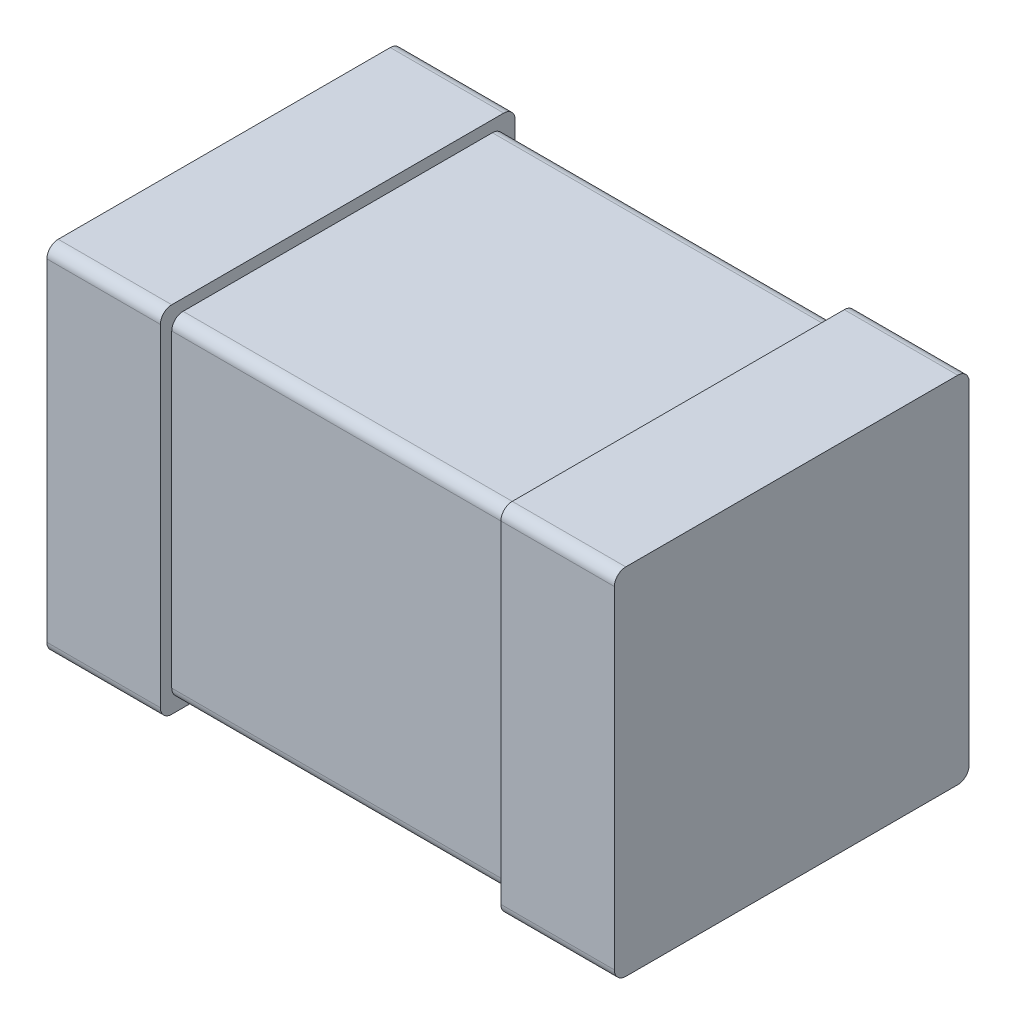
ISO-10303-21;
HEADER;
FILE_DESCRIPTION(('STEP AP214'),'2;1');
FILE_NAME('part.step','',(''),(''),'','','');
FILE_SCHEMA(('AUTOMOTIVE_DESIGN { 1 0 10303 214 1 1 1 1 }'));
ENDSEC;
DATA;
#1=APPLICATION_CONTEXT('core data for automotive mechanical design processes');
#2=APPLICATION_PROTOCOL_DEFINITION('international standard','automotive_design',2000,#1);
#3=PRODUCT_CONTEXT('',#1,'mechanical');
#4=PRODUCT('Part','Part','',(#3));
#5=PRODUCT_RELATED_PRODUCT_CATEGORY('part','',(#4));
#6=PRODUCT_DEFINITION_FORMATION('','',#4);
#7=PRODUCT_DEFINITION_CONTEXT('part definition',#1,'design');
#8=PRODUCT_DEFINITION('design','',#6,#7);
#9=PRODUCT_DEFINITION_SHAPE('','',#8);
#10=(LENGTH_UNIT() NAMED_UNIT(*) SI_UNIT(.MILLI.,.METRE.));
#11=(NAMED_UNIT(*) PLANE_ANGLE_UNIT() SI_UNIT($,.RADIAN.));
#12=(NAMED_UNIT(*) SI_UNIT($,.STERADIAN.) SOLID_ANGLE_UNIT());
#13=UNCERTAINTY_MEASURE_WITH_UNIT(LENGTH_MEASURE(1.E-05),#10,'distance_accuracy_value','');
#14=(GEOMETRIC_REPRESENTATION_CONTEXT(3) GLOBAL_UNCERTAINTY_ASSIGNED_CONTEXT((#13)) GLOBAL_UNIT_ASSIGNED_CONTEXT((#10,
#11,#12)) REPRESENTATION_CONTEXT('',''));
#15=CARTESIAN_POINT('',(0.,0.,0.));
#16=DIRECTION('',(0.,0.,1.));
#17=DIRECTION('',(1.,0.,0.));
#18=AXIS2_PLACEMENT_3D('',#15,#16,#17);
#19=CARTESIAN_POINT('',(-1.,-0.625,0.));
#20=DIRECTION('',(1.,0.,0.));
#21=DIRECTION('',(0.,1.,0.));
#22=AXIS2_PLACEMENT_3D('',#19,#20,#21);
#23=PLANE('',#22);
#24=CARTESIAN_POINT('',(-1.,-0.585,1.21));
#25=DIRECTION('',(-1.,0.,0.));
#26=DIRECTION('',(0.,0.,1.));
#27=AXIS2_PLACEMENT_3D('',#24,#25,#26);
#28=CIRCLE('',#27,0.04);
#29=CARTESIAN_POINT('',(-1.,-0.625,1.21));
#30=VERTEX_POINT('',#29);
#31=CARTESIAN_POINT('',(-1.,-0.585,1.25));
#32=VERTEX_POINT('',#31);
#33=EDGE_CURVE('E11',#30,#32,#28,.T.);
#34=ORIENTED_EDGE('',*,*,#33,.T.);
#35=DIRECTION('',(0.,1.,0.));
#36=VECTOR('',#35,1.);
#37=CARTESIAN_POINT('',(-1.,-0.625,1.25));
#38=LINE('',#37,#36);
#39=CARTESIAN_POINT('',(-1.,0.585,1.25));
#40=VERTEX_POINT('',#39);
#41=EDGE_CURVE('E27',#32,#40,#38,.T.);
#42=ORIENTED_EDGE('',*,*,#41,.T.);
#43=CARTESIAN_POINT('',(-1.,0.585,1.21));
#44=DIRECTION('',(1.,0.,0.));
#45=DIRECTION('',(0.,0.,1.));
#46=AXIS2_PLACEMENT_3D('',#43,#44,#45);
#47=CIRCLE('',#46,0.04);
#48=CARTESIAN_POINT('',(-1.,0.625,1.21));
#49=VERTEX_POINT('',#48);
#50=EDGE_CURVE('E368',#49,#40,#47,.T.);
#51=ORIENTED_EDGE('',*,*,#50,.F.);
#52=DIRECTION('',(0.,0.,1.));
#53=VECTOR('',#52,1.);
#54=CARTESIAN_POINT('',(-1.,0.625,0.));
#55=LINE('',#54,#53);
#56=CARTESIAN_POINT('',(-1.,0.625,0.04));
#57=VERTEX_POINT('',#56);
#58=EDGE_CURVE('E352',#57,#49,#55,.T.);
#59=ORIENTED_EDGE('',*,*,#58,.F.);
#60=CARTESIAN_POINT('',(-1.,0.585,0.04));
#61=DIRECTION('',(-1.,0.,0.));
#62=DIRECTION('',(0.,0.,1.));
#63=AXIS2_PLACEMENT_3D('',#60,#61,#62);
#64=CIRCLE('',#63,0.04);
#65=CARTESIAN_POINT('',(-1.,0.585,0.));
#66=VERTEX_POINT('',#65);
#67=EDGE_CURVE('E302',#57,#66,#64,.T.);
#68=ORIENTED_EDGE('',*,*,#67,.T.);
#69=DIRECTION('',(0.,1.,0.));
#70=VECTOR('',#69,1.);
#71=CARTESIAN_POINT('',(-1.,-0.625,0.));
#72=LINE('',#71,#70);
#73=CARTESIAN_POINT('',(-1.,-0.585,0.));
#74=VERTEX_POINT('',#73);
#75=EDGE_CURVE('E296',#74,#66,#72,.T.);
#76=ORIENTED_EDGE('',*,*,#75,.F.);
#77=CARTESIAN_POINT('',(-1.,-0.585,0.04));
#78=DIRECTION('',(1.,0.,0.));
#79=DIRECTION('',(0.,0.,1.));
#80=AXIS2_PLACEMENT_3D('',#77,#78,#79);
#81=CIRCLE('',#80,0.04);
#82=CARTESIAN_POINT('',(-1.,-0.625,0.04));
#83=VERTEX_POINT('',#82);
#84=EDGE_CURVE('E351',#83,#74,#81,.T.);
#85=ORIENTED_EDGE('',*,*,#84,.F.);
#86=DIRECTION('',(0.,0.,1.));
#87=VECTOR('',#86,1.);
#88=CARTESIAN_POINT('',(-1.,-0.625,0.));
#89=LINE('',#88,#87);
#90=EDGE_CURVE('E361',#83,#30,#89,.T.);
#91=ORIENTED_EDGE('',*,*,#90,.T.);
#92=EDGE_LOOP('',(#34,#42,#51,#59,#68,#76,#85,#91));
#93=FACE_BOUND('',#92,.T.);
#94=ADVANCED_FACE('F16',(#93),#23,.F.);
#95=CARTESIAN_POINT('',(-1.,-0.625,0.));
#96=DIRECTION('',(0.,1.,0.));
#97=DIRECTION('',(1.,0.,0.));
#98=AXIS2_PLACEMENT_3D('',#95,#96,#97);
#99=PLANE('',#98);
#100=DIRECTION('',(1.,0.,0.));
#101=VECTOR('',#100,1.);
#102=CARTESIAN_POINT('',(-1.,-0.625,1.21));
#103=LINE('',#102,#101);
#104=CARTESIAN_POINT('',(-0.6,-0.625,1.21));
#105=VERTEX_POINT('',#104);
#106=EDGE_CURVE('E337',#30,#105,#103,.T.);
#107=ORIENTED_EDGE('',*,*,#106,.F.);
#108=ORIENTED_EDGE('',*,*,#90,.F.);
#109=DIRECTION('',(1.,0.,0.));
#110=VECTOR('',#109,1.);
#111=CARTESIAN_POINT('',(-1.,-0.625,0.04));
#112=LINE('',#111,#110);
#113=CARTESIAN_POINT('',(-0.6,-0.625,0.04));
#114=VERTEX_POINT('',#113);
#115=EDGE_CURVE('E364',#83,#114,#112,.T.);
#116=ORIENTED_EDGE('',*,*,#115,.T.);
#117=DIRECTION('',(0.,0.,1.));
#118=VECTOR('',#117,1.);
#119=CARTESIAN_POINT('',(-0.6,-0.625,0.));
#120=LINE('',#119,#118);
#121=EDGE_CURVE('E439',#114,#105,#120,.T.);
#122=ORIENTED_EDGE('',*,*,#121,.T.);
#123=EDGE_LOOP('',(#107,#108,#116,#122));
#124=FACE_BOUND('',#123,.T.);
#125=ADVANCED_FACE('F611',(#124),#99,.F.);
#126=CARTESIAN_POINT('',(-1.,-0.585,0.04));
#127=DIRECTION('',(1.,0.,0.));
#128=DIRECTION('',(0.,-1.,0.));
#129=AXIS2_PLACEMENT_3D('',#126,#127,#128);
#130=CYLINDRICAL_SURFACE('',#129,0.04);
#131=ORIENTED_EDGE('',*,*,#84,.T.);
#132=DIRECTION('',(1.,0.,0.));
#133=VECTOR('',#132,1.);
#134=CARTESIAN_POINT('',(-1.,-0.585,0.));
#135=LINE('',#134,#133);
#136=CARTESIAN_POINT('',(-0.6,-0.585,0.));
#137=VERTEX_POINT('',#136);
#138=EDGE_CURVE('E340',#74,#137,#135,.T.);
#139=ORIENTED_EDGE('',*,*,#138,.T.);
#140=CARTESIAN_POINT('',(-0.6,-0.585,0.04));
#141=DIRECTION('',(1.,0.,0.));
#142=DIRECTION('',(0.,0.,1.));
#143=AXIS2_PLACEMENT_3D('',#140,#141,#142);
#144=CIRCLE('',#143,0.04);
#145=EDGE_CURVE('E342',#114,#137,#144,.T.);
#146=ORIENTED_EDGE('',*,*,#145,.F.);
#147=ORIENTED_EDGE('',*,*,#115,.F.);
#148=EDGE_LOOP('',(#131,#139,#146,#147));
#149=FACE_BOUND('',#148,.T.);
#150=ADVANCED_FACE('F582',(#149),#130,.T.);
#151=CARTESIAN_POINT('',(-1.,-0.585,1.21));
#152=DIRECTION('',(1.,0.,0.));
#153=DIRECTION('',(0.,-1.,0.));
#154=AXIS2_PLACEMENT_3D('',#151,#152,#153);
#155=CYLINDRICAL_SURFACE('',#154,0.04);
#156=ORIENTED_EDGE('',*,*,#106,.T.);
#157=CARTESIAN_POINT('',(-0.6,-0.585,1.21));
#158=DIRECTION('',(-1.,0.,0.));
#159=DIRECTION('',(0.,0.,1.));
#160=AXIS2_PLACEMENT_3D('',#157,#158,#159);
#161=CIRCLE('',#160,0.04);
#162=CARTESIAN_POINT('',(-0.6,-0.585,1.25));
#163=VERTEX_POINT('',#162);
#164=EDGE_CURVE('E341',#105,#163,#161,.T.);
#165=ORIENTED_EDGE('',*,*,#164,.T.);
#166=DIRECTION('',(1.,0.,0.));
#167=VECTOR('',#166,1.);
#168=CARTESIAN_POINT('',(-1.,-0.585,1.25));
#169=LINE('',#168,#167);
#170=EDGE_CURVE('E293',#32,#163,#169,.T.);
#171=ORIENTED_EDGE('',*,*,#170,.F.);
#172=ORIENTED_EDGE('',*,*,#33,.F.);
#173=EDGE_LOOP('',(#156,#165,#171,#172));
#174=FACE_BOUND('',#173,.T.);
#175=ADVANCED_FACE('F578',(#174),#155,.T.);
#176=CARTESIAN_POINT('',(-1.,-0.625,0.));
#177=DIRECTION('',(0.,0.,1.));
#178=DIRECTION('',(1.,0.,0.));
#179=AXIS2_PLACEMENT_3D('',#176,#177,#178);
#180=PLANE('',#179);
#181=DIRECTION('',(1.,0.,0.));
#182=VECTOR('',#181,1.);
#183=CARTESIAN_POINT('',(-1.,0.585,0.));
#184=LINE('',#183,#182);
#185=CARTESIAN_POINT('',(-0.6,0.585,0.));
#186=VERTEX_POINT('',#185);
#187=EDGE_CURVE('E360',#66,#186,#184,.T.);
#188=ORIENTED_EDGE('',*,*,#187,.T.);
#189=DIRECTION('',(0.,1.,0.));
#190=VECTOR('',#189,1.);
#191=CARTESIAN_POINT('',(-0.6,-0.625,0.));
#192=LINE('',#191,#190);
#193=EDGE_CURVE('E306',#137,#186,#192,.T.);
#194=ORIENTED_EDGE('',*,*,#193,.F.);
#195=ORIENTED_EDGE('',*,*,#138,.F.);
#196=ORIENTED_EDGE('',*,*,#75,.T.);
#197=EDGE_LOOP('',(#188,#194,#195,#196));
#198=FACE_BOUND('',#197,.T.);
#199=ADVANCED_FACE('F521',(#198),#180,.F.);
#200=CARTESIAN_POINT('',(-1.,-0.625,1.25));
#201=DIRECTION('',(0.,0.,1.));
#202=DIRECTION('',(1.,0.,0.));
#203=AXIS2_PLACEMENT_3D('',#200,#201,#202);
#204=PLANE('',#203);
#205=ORIENTED_EDGE('',*,*,#41,.F.);
#206=ORIENTED_EDGE('',*,*,#170,.T.);
#207=DIRECTION('',(0.,1.,0.));
#208=VECTOR('',#207,1.);
#209=CARTESIAN_POINT('',(-0.6,-0.625,1.25));
#210=LINE('',#209,#208);
#211=CARTESIAN_POINT('',(-0.6,0.585,1.25));
#212=VERTEX_POINT('',#211);
#213=EDGE_CURVE('E256',#163,#212,#210,.T.);
#214=ORIENTED_EDGE('',*,*,#213,.T.);
#215=DIRECTION('',(1.,0.,0.));
#216=VECTOR('',#215,1.);
#217=CARTESIAN_POINT('',(-1.,0.585,1.25));
#218=LINE('',#217,#216);
#219=EDGE_CURVE('E356',#40,#212,#218,.T.);
#220=ORIENTED_EDGE('',*,*,#219,.F.);
#221=EDGE_LOOP('',(#205,#206,#214,#220));
#222=FACE_BOUND('',#221,.T.);
#223=ADVANCED_FACE('F18',(#222),#204,.T.);
#224=CARTESIAN_POINT('',(-1.,0.585,0.04));
#225=DIRECTION('',(1.,0.,0.));
#226=DIRECTION('',(0.,1.,0.));
#227=AXIS2_PLACEMENT_3D('',#224,#225,#226);
#228=CYLINDRICAL_SURFACE('',#227,0.04);
#229=DIRECTION('',(1.,0.,0.));
#230=VECTOR('',#229,1.);
#231=CARTESIAN_POINT('',(-1.,0.625,0.04));
#232=LINE('',#231,#230);
#233=CARTESIAN_POINT('',(-0.6,0.625,0.04));
#234=VERTEX_POINT('',#233);
#235=EDGE_CURVE('E253',#57,#234,#232,.T.);
#236=ORIENTED_EDGE('',*,*,#235,.T.);
#237=CARTESIAN_POINT('',(-0.6,0.585,0.04));
#238=DIRECTION('',(-1.,0.,0.));
#239=DIRECTION('',(0.,0.,1.));
#240=AXIS2_PLACEMENT_3D('',#237,#238,#239);
#241=CIRCLE('',#240,0.04);
#242=EDGE_CURVE('E257',#234,#186,#241,.T.);
#243=ORIENTED_EDGE('',*,*,#242,.T.);
#244=ORIENTED_EDGE('',*,*,#187,.F.);
#245=ORIENTED_EDGE('',*,*,#67,.F.);
#246=EDGE_LOOP('',(#236,#243,#244,#245));
#247=FACE_BOUND('',#246,.T.);
#248=ADVANCED_FACE('F520',(#247),#228,.T.);
#249=CARTESIAN_POINT('',(-1.,0.585,1.21));
#250=DIRECTION('',(1.,0.,0.));
#251=DIRECTION('',(0.,1.,0.));
#252=AXIS2_PLACEMENT_3D('',#249,#250,#251);
#253=CYLINDRICAL_SURFACE('',#252,0.04);
#254=ORIENTED_EDGE('',*,*,#50,.T.);
#255=ORIENTED_EDGE('',*,*,#219,.T.);
#256=CARTESIAN_POINT('',(-0.6,0.585,1.21));
#257=DIRECTION('',(1.,0.,0.));
#258=DIRECTION('',(0.,0.,1.));
#259=AXIS2_PLACEMENT_3D('',#256,#257,#258);
#260=CIRCLE('',#259,0.04);
#261=CARTESIAN_POINT('',(-0.6,0.625,1.21));
#262=VERTEX_POINT('',#261);
#263=EDGE_CURVE('E281',#262,#212,#260,.T.);
#264=ORIENTED_EDGE('',*,*,#263,.F.);
#265=DIRECTION('',(1.,0.,0.));
#266=VECTOR('',#265,1.);
#267=CARTESIAN_POINT('',(-1.,0.625,1.21));
#268=LINE('',#267,#266);
#269=EDGE_CURVE('E345',#49,#262,#268,.T.);
#270=ORIENTED_EDGE('',*,*,#269,.F.);
#271=EDGE_LOOP('',(#254,#255,#264,#270));
#272=FACE_BOUND('',#271,.T.);
#273=ADVANCED_FACE('F676',(#272),#253,.T.);
#274=CARTESIAN_POINT('',(-1.,0.625,0.));
#275=DIRECTION('',(0.,1.,0.));
#276=DIRECTION('',(1.,0.,0.));
#277=AXIS2_PLACEMENT_3D('',#274,#275,#276);
#278=PLANE('',#277);
#279=DIRECTION('',(0.,0.,1.));
#280=VECTOR('',#279,1.);
#281=CARTESIAN_POINT('',(-0.6,0.625,0.));
#282=LINE('',#281,#280);
#283=EDGE_CURVE('E285',#234,#262,#282,.T.);
#284=ORIENTED_EDGE('',*,*,#283,.F.);
#285=ORIENTED_EDGE('',*,*,#235,.F.);
#286=ORIENTED_EDGE('',*,*,#58,.T.);
#287=ORIENTED_EDGE('',*,*,#269,.T.);
#288=EDGE_LOOP('',(#284,#285,#286,#287));
#289=FACE_BOUND('',#288,.T.);
#290=ADVANCED_FACE('F541',(#289),#278,.T.);
#291=CARTESIAN_POINT('',(-0.6,-0.625,0.));
#292=DIRECTION('',(1.,0.,0.));
#293=DIRECTION('',(0.,1.,0.));
#294=AXIS2_PLACEMENT_3D('',#291,#292,#293);
#295=PLANE('',#294);
#296=ORIENTED_EDGE('',*,*,#121,.F.);
#297=ORIENTED_EDGE('',*,*,#145,.T.);
#298=ORIENTED_EDGE('',*,*,#193,.T.);
#299=ORIENTED_EDGE('',*,*,#242,.F.);
#300=ORIENTED_EDGE('',*,*,#283,.T.);
#301=ORIENTED_EDGE('',*,*,#263,.T.);
#302=ORIENTED_EDGE('',*,*,#213,.F.);
#303=ORIENTED_EDGE('',*,*,#164,.F.);
#304=EDGE_LOOP('',(#296,#297,#298,#299,#300,#301,#302,#303));
#305=FACE_BOUND('',#304,.T.);
#306=CARTESIAN_POINT('',(-0.6,-0.545,0.08));
#307=DIRECTION('',(1.,0.,0.));
#308=DIRECTION('',(0.,0.,1.));
#309=AXIS2_PLACEMENT_3D('',#306,#307,#308);
#310=CIRCLE('',#309,0.04);
#311=CARTESIAN_POINT('',(-0.6,-0.585,0.08));
#312=VERTEX_POINT('',#311);
#313=CARTESIAN_POINT('',(-0.6,-0.545,0.04));
#314=VERTEX_POINT('',#313);
#315=EDGE_CURVE('E445',#312,#314,#310,.T.);
#316=ORIENTED_EDGE('',*,*,#315,.F.);
#317=DIRECTION('',(0.,0.,1.));
#318=VECTOR('',#317,1.);
#319=CARTESIAN_POINT('',(-0.6,-0.585,0.04));
#320=LINE('',#319,#318);
#321=CARTESIAN_POINT('',(-0.6,-0.585,1.17));
#322=VERTEX_POINT('',#321);
#323=EDGE_CURVE('E286',#312,#322,#320,.T.);
#324=ORIENTED_EDGE('',*,*,#323,.T.);
#325=CARTESIAN_POINT('',(-0.6,-0.545,1.17));
#326=DIRECTION('',(-1.,0.,0.));
#327=DIRECTION('',(0.,0.,1.));
#328=AXIS2_PLACEMENT_3D('',#325,#326,#327);
#329=CIRCLE('',#328,0.04);
#330=CARTESIAN_POINT('',(-0.6,-0.545,1.21));
#331=VERTEX_POINT('',#330);
#332=EDGE_CURVE('E291',#322,#331,#329,.T.);
#333=ORIENTED_EDGE('',*,*,#332,.T.);
#334=DIRECTION('',(0.,1.,0.));
#335=VECTOR('',#334,1.);
#336=CARTESIAN_POINT('',(-0.6,-0.585,1.21));
#337=LINE('',#336,#335);
#338=CARTESIAN_POINT('',(-0.6,0.545,1.21));
#339=VERTEX_POINT('',#338);
#340=EDGE_CURVE('E287',#331,#339,#337,.T.);
#341=ORIENTED_EDGE('',*,*,#340,.T.);
#342=CARTESIAN_POINT('',(-0.6,0.545,1.17));
#343=DIRECTION('',(1.,0.,0.));
#344=DIRECTION('',(0.,0.,1.));
#345=AXIS2_PLACEMENT_3D('',#342,#343,#344);
#346=CIRCLE('',#345,0.04);
#347=CARTESIAN_POINT('',(-0.6,0.585,1.17));
#348=VERTEX_POINT('',#347);
#349=EDGE_CURVE('E263',#348,#339,#346,.T.);
#350=ORIENTED_EDGE('',*,*,#349,.F.);
#351=DIRECTION('',(0.,0.,1.));
#352=VECTOR('',#351,1.);
#353=CARTESIAN_POINT('',(-0.6,0.585,0.04));
#354=LINE('',#353,#352);
#355=CARTESIAN_POINT('',(-0.6,0.585,0.08));
#356=VERTEX_POINT('',#355);
#357=EDGE_CURVE('E262',#356,#348,#354,.T.);
#358=ORIENTED_EDGE('',*,*,#357,.F.);
#359=CARTESIAN_POINT('',(-0.6,0.545,0.08));
#360=DIRECTION('',(-1.,0.,0.));
#361=DIRECTION('',(0.,0.,1.));
#362=AXIS2_PLACEMENT_3D('',#359,#360,#361);
#363=CIRCLE('',#362,0.04);
#364=CARTESIAN_POINT('',(-0.6,0.545,0.04));
#365=VERTEX_POINT('',#364);
#366=EDGE_CURVE('E292',#356,#365,#363,.T.);
#367=ORIENTED_EDGE('',*,*,#366,.T.);
#368=DIRECTION('',(0.,1.,0.));
#369=VECTOR('',#368,1.);
#370=CARTESIAN_POINT('',(-0.6,-0.585,0.04));
#371=LINE('',#370,#369);
#372=EDGE_CURVE('E272',#314,#365,#371,.T.);
#373=ORIENTED_EDGE('',*,*,#372,.F.);
#374=EDGE_LOOP('',(#316,#324,#333,#341,#350,#358,#367,#373));
#375=FACE_BOUND('',#374,.T.);
#376=ADVANCED_FACE('F479',(#305,#375),#295,.T.);
#377=CARTESIAN_POINT('',(-0.6,-0.545,0.08));
#378=DIRECTION('',(1.,0.,0.));
#379=DIRECTION('',(0.,-1.,0.));
#380=AXIS2_PLACEMENT_3D('',#377,#378,#379);
#381=CYLINDRICAL_SURFACE('',#380,0.04);
#382=ORIENTED_EDGE('',*,*,#315,.T.);
#383=DIRECTION('',(1.,0.,0.));
#384=VECTOR('',#383,1.);
#385=CARTESIAN_POINT('',(-0.6,-0.545,0.04));
#386=LINE('',#385,#384);
#387=CARTESIAN_POINT('',(0.6,-0.545,0.04));
#388=VERTEX_POINT('',#387);
#389=EDGE_CURVE('E326',#314,#388,#386,.T.);
#390=ORIENTED_EDGE('',*,*,#389,.T.);
#391=CARTESIAN_POINT('',(0.6,-0.545,0.08));
#392=DIRECTION('',(1.,0.,0.));
#393=DIRECTION('',(0.,0.,1.));
#394=AXIS2_PLACEMENT_3D('',#391,#392,#393);
#395=CIRCLE('',#394,0.04);
#396=CARTESIAN_POINT('',(0.6,-0.585,0.08));
#397=VERTEX_POINT('',#396);
#398=EDGE_CURVE('E310',#397,#388,#395,.T.);
#399=ORIENTED_EDGE('',*,*,#398,.F.);
#400=DIRECTION('',(1.,0.,0.));
#401=VECTOR('',#400,1.);
#402=CARTESIAN_POINT('',(-0.6,-0.585,0.08));
#403=LINE('',#402,#401);
#404=EDGE_CURVE('E405',#312,#397,#403,.T.);
#405=ORIENTED_EDGE('',*,*,#404,.F.);
#406=EDGE_LOOP('',(#382,#390,#399,#405));
#407=FACE_BOUND('',#406,.T.);
#408=ADVANCED_FACE('F540',(#407),#381,.T.);
#409=CARTESIAN_POINT('',(-0.6,-0.585,0.04));
#410=DIRECTION('',(0.,0.,1.));
#411=DIRECTION('',(1.,0.,0.));
#412=AXIS2_PLACEMENT_3D('',#409,#410,#411);
#413=PLANE('',#412);
#414=DIRECTION('',(1.,0.,0.));
#415=VECTOR('',#414,1.);
#416=CARTESIAN_POINT('',(-0.6,0.545,0.04));
#417=LINE('',#416,#415);
#418=CARTESIAN_POINT('',(0.6,0.545,0.04));
#419=VERTEX_POINT('',#418);
#420=EDGE_CURVE('E275',#365,#419,#417,.T.);
#421=ORIENTED_EDGE('',*,*,#420,.T.);
#422=DIRECTION('',(0.,1.,0.));
#423=VECTOR('',#422,1.);
#424=CARTESIAN_POINT('',(0.6,-0.585,0.04));
#425=LINE('',#424,#423);
#426=EDGE_CURVE('E319',#388,#419,#425,.T.);
#427=ORIENTED_EDGE('',*,*,#426,.F.);
#428=ORIENTED_EDGE('',*,*,#389,.F.);
#429=ORIENTED_EDGE('',*,*,#372,.T.);
#430=EDGE_LOOP('',(#421,#427,#428,#429));
#431=FACE_BOUND('',#430,.T.);
#432=ADVANCED_FACE('F497',(#431),#413,.F.);
#433=CARTESIAN_POINT('',(-0.6,0.545,0.08));
#434=DIRECTION('',(1.,0.,0.));
#435=DIRECTION('',(0.,1.,0.));
#436=AXIS2_PLACEMENT_3D('',#433,#434,#435);
#437=CYLINDRICAL_SURFACE('',#436,0.04);
#438=DIRECTION('',(1.,0.,0.));
#439=VECTOR('',#438,1.);
#440=CARTESIAN_POINT('',(-0.6,0.585,0.08));
#441=LINE('',#440,#439);
#442=CARTESIAN_POINT('',(0.6,0.585,0.08));
#443=VERTEX_POINT('',#442);
#444=EDGE_CURVE('E276',#356,#443,#441,.T.);
#445=ORIENTED_EDGE('',*,*,#444,.T.);
#446=CARTESIAN_POINT('',(0.6,0.545,0.08));
#447=DIRECTION('',(-1.,0.,0.));
#448=DIRECTION('',(0.,0.,1.));
#449=AXIS2_PLACEMENT_3D('',#446,#447,#448);
#450=CIRCLE('',#449,0.04);
#451=EDGE_CURVE('E374',#443,#419,#450,.T.);
#452=ORIENTED_EDGE('',*,*,#451,.T.);
#453=ORIENTED_EDGE('',*,*,#420,.F.);
#454=ORIENTED_EDGE('',*,*,#366,.F.);
#455=EDGE_LOOP('',(#445,#452,#453,#454));
#456=FACE_BOUND('',#455,.T.);
#457=ADVANCED_FACE('F495',(#456),#437,.T.);
#458=CARTESIAN_POINT('',(-0.6,0.585,0.04));
#459=DIRECTION('',(0.,1.,0.));
#460=DIRECTION('',(1.,0.,0.));
#461=AXIS2_PLACEMENT_3D('',#458,#459,#460);
#462=PLANE('',#461);
#463=DIRECTION('',(0.,0.,1.));
#464=VECTOR('',#463,1.);
#465=CARTESIAN_POINT('',(0.6,0.585,0.04));
#466=LINE('',#465,#464);
#467=CARTESIAN_POINT('',(0.6,0.585,1.17));
#468=VERTEX_POINT('',#467);
#469=EDGE_CURVE('E309',#443,#468,#466,.T.);
#470=ORIENTED_EDGE('',*,*,#469,.F.);
#471=ORIENTED_EDGE('',*,*,#444,.F.);
#472=ORIENTED_EDGE('',*,*,#357,.T.);
#473=DIRECTION('',(1.,0.,0.));
#474=VECTOR('',#473,1.);
#475=CARTESIAN_POINT('',(-0.6,0.585,1.17));
#476=LINE('',#475,#474);
#477=EDGE_CURVE('E258',#348,#468,#476,.T.);
#478=ORIENTED_EDGE('',*,*,#477,.T.);
#479=EDGE_LOOP('',(#470,#471,#472,#478));
#480=FACE_BOUND('',#479,.T.);
#481=ADVANCED_FACE('F490',(#480),#462,.T.);
#482=CARTESIAN_POINT('',(-0.6,0.545,1.17));
#483=DIRECTION('',(1.,0.,0.));
#484=DIRECTION('',(0.,1.,0.));
#485=AXIS2_PLACEMENT_3D('',#482,#483,#484);
#486=CYLINDRICAL_SURFACE('',#485,0.04);
#487=ORIENTED_EDGE('',*,*,#349,.T.);
#488=DIRECTION('',(1.,0.,0.));
#489=VECTOR('',#488,1.);
#490=CARTESIAN_POINT('',(-0.6,0.545,1.21));
#491=LINE('',#490,#489);
#492=CARTESIAN_POINT('',(0.6,0.545,1.21));
#493=VERTEX_POINT('',#492);
#494=EDGE_CURVE('E421',#339,#493,#491,.T.);
#495=ORIENTED_EDGE('',*,*,#494,.T.);
#496=CARTESIAN_POINT('',(0.6,0.545,1.17));
#497=DIRECTION('',(1.,0.,0.));
#498=DIRECTION('',(0.,0.,1.));
#499=AXIS2_PLACEMENT_3D('',#496,#497,#498);
#500=CIRCLE('',#499,0.04);
#501=EDGE_CURVE('E307',#468,#493,#500,.T.);
#502=ORIENTED_EDGE('',*,*,#501,.F.);
#503=ORIENTED_EDGE('',*,*,#477,.F.);
#504=EDGE_LOOP('',(#487,#495,#502,#503));
#505=FACE_BOUND('',#504,.T.);
#506=ADVANCED_FACE('F473',(#505),#486,.T.);
#507=CARTESIAN_POINT('',(-0.6,-0.585,1.21));
#508=DIRECTION('',(0.,0.,1.));
#509=DIRECTION('',(1.,0.,0.));
#510=AXIS2_PLACEMENT_3D('',#507,#508,#509);
#511=PLANE('',#510);
#512=ORIENTED_EDGE('',*,*,#340,.F.);
#513=DIRECTION('',(1.,0.,0.));
#514=VECTOR('',#513,1.);
#515=CARTESIAN_POINT('',(-0.6,-0.545,1.21));
#516=LINE('',#515,#514);
#517=CARTESIAN_POINT('',(0.6,-0.545,1.21));
#518=VERTEX_POINT('',#517);
#519=EDGE_CURVE('E20',#331,#518,#516,.T.);
#520=ORIENTED_EDGE('',*,*,#519,.T.);
#521=DIRECTION('',(0.,1.,0.));
#522=VECTOR('',#521,1.);
#523=CARTESIAN_POINT('',(0.6,-0.585,1.21));
#524=LINE('',#523,#522);
#525=EDGE_CURVE('E267',#518,#493,#524,.T.);
#526=ORIENTED_EDGE('',*,*,#525,.T.);
#527=ORIENTED_EDGE('',*,*,#494,.F.);
#528=EDGE_LOOP('',(#512,#520,#526,#527));
#529=FACE_BOUND('',#528,.T.);
#530=ADVANCED_FACE('F483',(#529),#511,.T.);
#531=CARTESIAN_POINT('',(-0.6,-0.545,1.17));
#532=DIRECTION('',(1.,0.,0.));
#533=DIRECTION('',(0.,-1.,0.));
#534=AXIS2_PLACEMENT_3D('',#531,#532,#533);
#535=CYLINDRICAL_SURFACE('',#534,0.04);
#536=DIRECTION('',(1.,0.,0.));
#537=VECTOR('',#536,1.);
#538=CARTESIAN_POINT('',(-0.6,-0.585,1.17));
#539=LINE('',#538,#537);
#540=CARTESIAN_POINT('',(0.6,-0.585,1.17));
#541=VERTEX_POINT('',#540);
#542=EDGE_CURVE('E271',#322,#541,#539,.T.);
#543=ORIENTED_EDGE('',*,*,#542,.T.);
#544=CARTESIAN_POINT('',(0.6,-0.545,1.17));
#545=DIRECTION('',(-1.,0.,0.));
#546=DIRECTION('',(0.,0.,1.));
#547=AXIS2_PLACEMENT_3D('',#544,#545,#546);
#548=CIRCLE('',#547,0.04);
#549=EDGE_CURVE('E401',#541,#518,#548,.T.);
#550=ORIENTED_EDGE('',*,*,#549,.T.);
#551=ORIENTED_EDGE('',*,*,#519,.F.);
#552=ORIENTED_EDGE('',*,*,#332,.F.);
#553=EDGE_LOOP('',(#543,#550,#551,#552));
#554=FACE_BOUND('',#553,.T.);
#555=ADVANCED_FACE('F531',(#554),#535,.T.);
#556=CARTESIAN_POINT('',(-0.6,-0.585,0.04));
#557=DIRECTION('',(0.,1.,0.));
#558=DIRECTION('',(1.,0.,0.));
#559=AXIS2_PLACEMENT_3D('',#556,#557,#558);
#560=PLANE('',#559);
#561=ORIENTED_EDGE('',*,*,#542,.F.);
#562=ORIENTED_EDGE('',*,*,#323,.F.);
#563=ORIENTED_EDGE('',*,*,#404,.T.);
#564=DIRECTION('',(0.,0.,1.));
#565=VECTOR('',#564,1.);
#566=CARTESIAN_POINT('',(0.6,-0.585,0.04));
#567=LINE('',#566,#565);
#568=EDGE_CURVE('E280',#397,#541,#567,.T.);
#569=ORIENTED_EDGE('',*,*,#568,.T.);
#570=EDGE_LOOP('',(#561,#562,#563,#569));
#571=FACE_BOUND('',#570,.T.);
#572=ADVANCED_FACE('F561',(#571),#560,.F.);
#573=CARTESIAN_POINT('',(0.6,-0.625,0.));
#574=DIRECTION('',(1.,0.,0.));
#575=DIRECTION('',(0.,1.,0.));
#576=AXIS2_PLACEMENT_3D('',#573,#574,#575);
#577=PLANE('',#576);
#578=CARTESIAN_POINT('',(0.6,-0.585,1.21));
#579=DIRECTION('',(-1.,0.,0.));
#580=DIRECTION('',(0.,0.,1.));
#581=AXIS2_PLACEMENT_3D('',#578,#579,#580);
#582=CIRCLE('',#581,0.04);
#583=CARTESIAN_POINT('',(0.6,-0.625,1.21));
#584=VERTEX_POINT('',#583);
#585=CARTESIAN_POINT('',(0.6,-0.585,1.25));
#586=VERTEX_POINT('',#585);
#587=EDGE_CURVE('E277',#584,#586,#582,.T.);
#588=ORIENTED_EDGE('',*,*,#587,.T.);
#589=DIRECTION('',(0.,1.,0.));
#590=VECTOR('',#589,1.);
#591=CARTESIAN_POINT('',(0.6,-0.625,1.25));
#592=LINE('',#591,#590);
#593=CARTESIAN_POINT('',(0.6,0.585,1.25));
#594=VERTEX_POINT('',#593);
#595=EDGE_CURVE('E219',#586,#594,#592,.T.);
#596=ORIENTED_EDGE('',*,*,#595,.T.);
#597=CARTESIAN_POINT('',(0.6,0.585,1.21));
#598=DIRECTION('',(1.,0.,0.));
#599=DIRECTION('',(0.,0.,1.));
#600=AXIS2_PLACEMENT_3D('',#597,#598,#599);
#601=CIRCLE('',#600,0.04);
#602=CARTESIAN_POINT('',(0.6,0.625,1.21));
#603=VERTEX_POINT('',#602);
#604=EDGE_CURVE('E320',#603,#594,#601,.T.);
#605=ORIENTED_EDGE('',*,*,#604,.F.);
#606=DIRECTION('',(0.,0.,1.));
#607=VECTOR('',#606,1.);
#608=CARTESIAN_POINT('',(0.6,0.625,0.));
#609=LINE('',#608,#607);
#610=CARTESIAN_POINT('',(0.6,0.625,0.04));
#611=VERTEX_POINT('',#610);
#612=EDGE_CURVE('E425',#611,#603,#609,.T.);
#613=ORIENTED_EDGE('',*,*,#612,.F.);
#614=CARTESIAN_POINT('',(0.6,0.585,0.04));
#615=DIRECTION('',(-1.,0.,0.));
#616=DIRECTION('',(0.,0.,1.));
#617=AXIS2_PLACEMENT_3D('',#614,#615,#616);
#618=CIRCLE('',#617,0.04);
#619=CARTESIAN_POINT('',(0.6,0.585,0.));
#620=VERTEX_POINT('',#619);
#621=EDGE_CURVE('E332',#611,#620,#618,.T.);
#622=ORIENTED_EDGE('',*,*,#621,.T.);
#623=DIRECTION('',(0.,1.,0.));
#624=VECTOR('',#623,1.);
#625=CARTESIAN_POINT('',(0.6,-0.625,0.));
#626=LINE('',#625,#624);
#627=CARTESIAN_POINT('',(0.6,-0.585,0.));
#628=VERTEX_POINT('',#627);
#629=EDGE_CURVE('E224',#628,#620,#626,.T.);
#630=ORIENTED_EDGE('',*,*,#629,.F.);
#631=CARTESIAN_POINT('',(0.6,-0.585,0.04));
#632=DIRECTION('',(1.,0.,0.));
#633=DIRECTION('',(0.,0.,1.));
#634=AXIS2_PLACEMENT_3D('',#631,#632,#633);
#635=CIRCLE('',#634,0.04);
#636=CARTESIAN_POINT('',(0.6,-0.625,0.04));
#637=VERTEX_POINT('',#636);
#638=EDGE_CURVE('E395',#637,#628,#635,.T.);
#639=ORIENTED_EDGE('',*,*,#638,.F.);
#640=DIRECTION('',(0.,0.,1.));
#641=VECTOR('',#640,1.);
#642=CARTESIAN_POINT('',(0.6,-0.625,0.));
#643=LINE('',#642,#641);
#644=EDGE_CURVE('E336',#637,#584,#643,.T.);
#645=ORIENTED_EDGE('',*,*,#644,.T.);
#646=EDGE_LOOP('',(#588,#596,#605,#613,#622,#630,#639,#645));
#647=FACE_BOUND('',#646,.T.);
#648=ORIENTED_EDGE('',*,*,#426,.T.);
#649=ORIENTED_EDGE('',*,*,#451,.F.);
#650=ORIENTED_EDGE('',*,*,#469,.T.);
#651=ORIENTED_EDGE('',*,*,#501,.T.);
#652=ORIENTED_EDGE('',*,*,#525,.F.);
#653=ORIENTED_EDGE('',*,*,#549,.F.);
#654=ORIENTED_EDGE('',*,*,#568,.F.);
#655=ORIENTED_EDGE('',*,*,#398,.T.);
#656=EDGE_LOOP('',(#648,#649,#650,#651,#652,#653,#654,#655));
#657=FACE_BOUND('',#656,.T.);
#658=ADVANCED_FACE('F484',(#647,#657),#577,.F.);
#659=CARTESIAN_POINT('',(0.6,-0.625,0.));
#660=DIRECTION('',(0.,1.,0.));
#661=DIRECTION('',(1.,0.,0.));
#662=AXIS2_PLACEMENT_3D('',#659,#660,#661);
#663=PLANE('',#662);
#664=DIRECTION('',(1.,0.,0.));
#665=VECTOR('',#664,1.);
#666=CARTESIAN_POINT('',(0.6,-0.625,1.21));
#667=LINE('',#666,#665);
#668=CARTESIAN_POINT('',(1.,-0.625,1.21));
#669=VERTEX_POINT('',#668);
#670=EDGE_CURVE('E230',#584,#669,#667,.T.);
#671=ORIENTED_EDGE('',*,*,#670,.F.);
#672=ORIENTED_EDGE('',*,*,#644,.F.);
#673=DIRECTION('',(1.,0.,0.));
#674=VECTOR('',#673,1.);
#675=CARTESIAN_POINT('',(0.6,-0.625,0.04));
#676=LINE('',#675,#674);
#677=CARTESIAN_POINT('',(1.,-0.625,0.04));
#678=VERTEX_POINT('',#677);
#679=EDGE_CURVE('E376',#637,#678,#676,.T.);
#680=ORIENTED_EDGE('',*,*,#679,.T.);
#681=DIRECTION('',(0.,0.,1.));
#682=VECTOR('',#681,1.);
#683=CARTESIAN_POINT('',(1.,-0.625,0.));
#684=LINE('',#683,#682);
#685=EDGE_CURVE('E385',#678,#669,#684,.T.);
#686=ORIENTED_EDGE('',*,*,#685,.T.);
#687=EDGE_LOOP('',(#671,#672,#680,#686));
#688=FACE_BOUND('',#687,.T.);
#689=ADVANCED_FACE('F592',(#688),#663,.F.);
#690=CARTESIAN_POINT('',(0.6,-0.585,0.04));
#691=DIRECTION('',(1.,0.,0.));
#692=DIRECTION('',(0.,-1.,0.));
#693=AXIS2_PLACEMENT_3D('',#690,#691,#692);
#694=CYLINDRICAL_SURFACE('',#693,0.04);
#695=ORIENTED_EDGE('',*,*,#638,.T.);
#696=DIRECTION('',(1.,0.,0.));
#697=VECTOR('',#696,1.);
#698=CARTESIAN_POINT('',(0.6,-0.585,0.));
#699=LINE('',#698,#697);
#700=CARTESIAN_POINT('',(1.,-0.585,0.));
#701=VERTEX_POINT('',#700);
#702=EDGE_CURVE('E408',#628,#701,#699,.T.);
#703=ORIENTED_EDGE('',*,*,#702,.T.);
#704=CARTESIAN_POINT('',(1.,-0.585,0.04));
#705=DIRECTION('',(1.,0.,0.));
#706=DIRECTION('',(0.,0.,1.));
#707=AXIS2_PLACEMENT_3D('',#704,#705,#706);
#708=CIRCLE('',#707,0.04);
#709=EDGE_CURVE('E315',#678,#701,#708,.T.);
#710=ORIENTED_EDGE('',*,*,#709,.F.);
#711=ORIENTED_EDGE('',*,*,#679,.F.);
#712=EDGE_LOOP('',(#695,#703,#710,#711));
#713=FACE_BOUND('',#712,.T.);
#714=ADVANCED_FACE('F552',(#713),#694,.T.);
#715=CARTESIAN_POINT('',(0.6,-0.585,1.21));
#716=DIRECTION('',(1.,0.,0.));
#717=DIRECTION('',(0.,-1.,0.));
#718=AXIS2_PLACEMENT_3D('',#715,#716,#717);
#719=CYLINDRICAL_SURFACE('',#718,0.04);
#720=ORIENTED_EDGE('',*,*,#670,.T.);
#721=CARTESIAN_POINT('',(1.,-0.585,1.21));
#722=DIRECTION('',(-1.,0.,0.));
#723=DIRECTION('',(0.,0.,1.));
#724=AXIS2_PLACEMENT_3D('',#721,#722,#723);
#725=CIRCLE('',#724,0.04);
#726=CARTESIAN_POINT('',(1.,-0.585,1.25));
#727=VERTEX_POINT('',#726);
#728=EDGE_CURVE('E227',#669,#727,#725,.T.);
#729=ORIENTED_EDGE('',*,*,#728,.T.);
#730=DIRECTION('',(1.,0.,0.));
#731=VECTOR('',#730,1.);
#732=CARTESIAN_POINT('',(0.6,-0.585,1.25));
#733=LINE('',#732,#731);
#734=EDGE_CURVE('E211',#586,#727,#733,.T.);
#735=ORIENTED_EDGE('',*,*,#734,.F.);
#736=ORIENTED_EDGE('',*,*,#587,.F.);
#737=EDGE_LOOP('',(#720,#729,#735,#736));
#738=FACE_BOUND('',#737,.T.);
#739=ADVANCED_FACE('F228',(#738),#719,.T.);
#740=CARTESIAN_POINT('',(0.6,-0.625,0.));
#741=DIRECTION('',(0.,0.,1.));
#742=DIRECTION('',(1.,0.,0.));
#743=AXIS2_PLACEMENT_3D('',#740,#741,#742);
#744=PLANE('',#743);
#745=DIRECTION('',(1.,0.,0.));
#746=VECTOR('',#745,1.);
#747=CARTESIAN_POINT('',(0.6,0.585,0.));
#748=LINE('',#747,#746);
#749=CARTESIAN_POINT('',(1.,0.585,0.));
#750=VERTEX_POINT('',#749);
#751=EDGE_CURVE('E234',#620,#750,#748,.T.);
#752=ORIENTED_EDGE('',*,*,#751,.T.);
#753=DIRECTION('',(0.,1.,0.));
#754=VECTOR('',#753,1.);
#755=CARTESIAN_POINT('',(1.,-0.625,0.));
#756=LINE('',#755,#754);
#757=EDGE_CURVE('E312',#701,#750,#756,.T.);
#758=ORIENTED_EDGE('',*,*,#757,.F.);
#759=ORIENTED_EDGE('',*,*,#702,.F.);
#760=ORIENTED_EDGE('',*,*,#629,.T.);
#761=EDGE_LOOP('',(#752,#758,#759,#760));
#762=FACE_BOUND('',#761,.T.);
#763=ADVANCED_FACE('F551',(#762),#744,.F.);
#764=CARTESIAN_POINT('',(0.6,-0.625,1.25));
#765=DIRECTION('',(0.,0.,1.));
#766=DIRECTION('',(1.,0.,0.));
#767=AXIS2_PLACEMENT_3D('',#764,#765,#766);
#768=PLANE('',#767);
#769=ORIENTED_EDGE('',*,*,#595,.F.);
#770=ORIENTED_EDGE('',*,*,#734,.T.);
#771=DIRECTION('',(0.,1.,0.));
#772=VECTOR('',#771,1.);
#773=CARTESIAN_POINT('',(1.,-0.625,1.25));
#774=LINE('',#773,#772);
#775=CARTESIAN_POINT('',(1.,0.585,1.25));
#776=VERTEX_POINT('',#775);
#777=EDGE_CURVE('E216',#727,#776,#774,.T.);
#778=ORIENTED_EDGE('',*,*,#777,.T.);
#779=DIRECTION('',(1.,0.,0.));
#780=VECTOR('',#779,1.);
#781=CARTESIAN_POINT('',(0.6,0.585,1.25));
#782=LINE('',#781,#780);
#783=EDGE_CURVE('E251',#594,#776,#782,.T.);
#784=ORIENTED_EDGE('',*,*,#783,.F.);
#785=EDGE_LOOP('',(#769,#770,#778,#784));
#786=FACE_BOUND('',#785,.T.);
#787=ADVANCED_FACE('F213',(#786),#768,.T.);
#788=CARTESIAN_POINT('',(0.6,0.585,0.04));
#789=DIRECTION('',(1.,0.,0.));
#790=DIRECTION('',(0.,1.,0.));
#791=AXIS2_PLACEMENT_3D('',#788,#789,#790);
#792=CYLINDRICAL_SURFACE('',#791,0.04);
#793=DIRECTION('',(1.,0.,0.));
#794=VECTOR('',#793,1.);
#795=CARTESIAN_POINT('',(0.6,0.625,0.04));
#796=LINE('',#795,#794);
#797=CARTESIAN_POINT('',(1.,0.625,0.04));
#798=VERTEX_POINT('',#797);
#799=EDGE_CURVE('E240',#611,#798,#796,.T.);
#800=ORIENTED_EDGE('',*,*,#799,.T.);
#801=CARTESIAN_POINT('',(1.,0.585,0.04));
#802=DIRECTION('',(-1.,0.,0.));
#803=DIRECTION('',(0.,0.,1.));
#804=AXIS2_PLACEMENT_3D('',#801,#802,#803);
#805=CIRCLE('',#804,0.04);
#806=EDGE_CURVE('E247',#798,#750,#805,.T.);
#807=ORIENTED_EDGE('',*,*,#806,.T.);
#808=ORIENTED_EDGE('',*,*,#751,.F.);
#809=ORIENTED_EDGE('',*,*,#621,.F.);
#810=EDGE_LOOP('',(#800,#807,#808,#809));
#811=FACE_BOUND('',#810,.T.);
#812=ADVANCED_FACE('F723',(#811),#792,.T.);
#813=CARTESIAN_POINT('',(0.6,0.585,1.21));
#814=DIRECTION('',(1.,0.,0.));
#815=DIRECTION('',(0.,1.,0.));
#816=AXIS2_PLACEMENT_3D('',#813,#814,#815);
#817=CYLINDRICAL_SURFACE('',#816,0.04);
#818=ORIENTED_EDGE('',*,*,#604,.T.);
#819=ORIENTED_EDGE('',*,*,#783,.T.);
#820=CARTESIAN_POINT('',(1.,0.585,1.21));
#821=DIRECTION('',(1.,0.,0.));
#822=DIRECTION('',(0.,0.,1.));
#823=AXIS2_PLACEMENT_3D('',#820,#821,#822);
#824=CIRCLE('',#823,0.04);
#825=CARTESIAN_POINT('',(1.,0.625,1.21));
#826=VERTEX_POINT('',#825);
#827=EDGE_CURVE('E238',#826,#776,#824,.T.);
#828=ORIENTED_EDGE('',*,*,#827,.F.);
#829=DIRECTION('',(1.,0.,0.));
#830=VECTOR('',#829,1.);
#831=CARTESIAN_POINT('',(0.6,0.625,1.21));
#832=LINE('',#831,#830);
#833=EDGE_CURVE('E428',#603,#826,#832,.T.);
#834=ORIENTED_EDGE('',*,*,#833,.F.);
#835=EDGE_LOOP('',(#818,#819,#828,#834));
#836=FACE_BOUND('',#835,.T.);
#837=ADVANCED_FACE('F704',(#836),#817,.T.);
#838=CARTESIAN_POINT('',(0.6,0.625,0.));
#839=DIRECTION('',(0.,1.,0.));
#840=DIRECTION('',(1.,0.,0.));
#841=AXIS2_PLACEMENT_3D('',#838,#839,#840);
#842=PLANE('',#841);
#843=DIRECTION('',(0.,0.,1.));
#844=VECTOR('',#843,1.);
#845=CARTESIAN_POINT('',(1.,0.625,0.));
#846=LINE('',#845,#844);
#847=EDGE_CURVE('E316',#798,#826,#846,.T.);
#848=ORIENTED_EDGE('',*,*,#847,.F.);
#849=ORIENTED_EDGE('',*,*,#799,.F.);
#850=ORIENTED_EDGE('',*,*,#612,.T.);
#851=ORIENTED_EDGE('',*,*,#833,.T.);
#852=EDGE_LOOP('',(#848,#849,#850,#851));
#853=FACE_BOUND('',#852,.T.);
#854=ADVANCED_FACE('F621',(#853),#842,.T.);
#855=CARTESIAN_POINT('',(1.,-0.625,0.));
#856=DIRECTION('',(1.,0.,0.));
#857=DIRECTION('',(0.,1.,0.));
#858=AXIS2_PLACEMENT_3D('',#855,#856,#857);
#859=PLANE('',#858);
#860=ORIENTED_EDGE('',*,*,#685,.F.);
#861=ORIENTED_EDGE('',*,*,#709,.T.);
#862=ORIENTED_EDGE('',*,*,#757,.T.);
#863=ORIENTED_EDGE('',*,*,#806,.F.);
#864=ORIENTED_EDGE('',*,*,#847,.T.);
#865=ORIENTED_EDGE('',*,*,#827,.T.);
#866=ORIENTED_EDGE('',*,*,#777,.F.);
#867=ORIENTED_EDGE('',*,*,#728,.F.);
#868=EDGE_LOOP('',(#860,#861,#862,#863,#864,#865,#866,#867));
#869=FACE_BOUND('',#868,.T.);
#870=ADVANCED_FACE('F236',(#869),#859,.T.);
#871=CLOSED_SHELL('',(#94,#125,#150,#175,#199,#223,#248,#273,#290,#376,#408,#432,#457,#481,#506,
#530,#555,#572,#658,#689,#714,#739,#763,#787,#812,#837,#854,#870));
#872=MANIFOLD_SOLID_BREP('B1',#871);
#873=ADVANCED_BREP_SHAPE_REPRESENTATION('',(#18,#872),#14);
#874=SHAPE_DEFINITION_REPRESENTATION(#9,#873);
ENDSEC;
END-ISO-10303-21;
